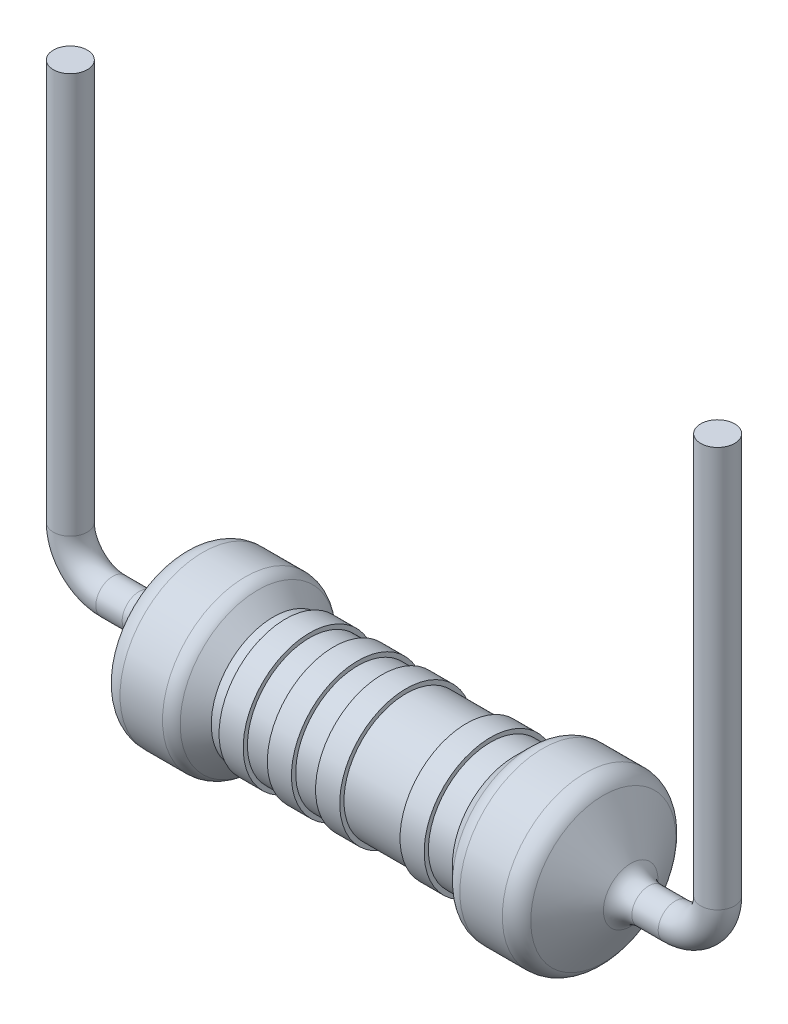
ISO-10303-21;
HEADER;
FILE_DESCRIPTION(('STEP AP214'),'2;1');
FILE_NAME('part.step','',(''),(''),'','','');
FILE_SCHEMA(('AUTOMOTIVE_DESIGN { 1 0 10303 214 1 1 1 1 }'));
ENDSEC;
DATA;
#1=APPLICATION_CONTEXT('core data for automotive mechanical design processes');
#2=APPLICATION_PROTOCOL_DEFINITION('international standard','automotive_design',2000,#1);
#3=PRODUCT_CONTEXT('',#1,'mechanical');
#4=PRODUCT('Part','Part','',(#3));
#5=PRODUCT_RELATED_PRODUCT_CATEGORY('part','',(#4));
#6=PRODUCT_DEFINITION_FORMATION('','',#4);
#7=PRODUCT_DEFINITION_CONTEXT('part definition',#1,'design');
#8=PRODUCT_DEFINITION('design','',#6,#7);
#9=PRODUCT_DEFINITION_SHAPE('','',#8);
#10=(LENGTH_UNIT() NAMED_UNIT(*) SI_UNIT(.MILLI.,.METRE.));
#11=(NAMED_UNIT(*) PLANE_ANGLE_UNIT() SI_UNIT($,.RADIAN.));
#12=(NAMED_UNIT(*) SI_UNIT($,.STERADIAN.) SOLID_ANGLE_UNIT());
#13=UNCERTAINTY_MEASURE_WITH_UNIT(LENGTH_MEASURE(1.E-05),#10,'distance_accuracy_value','');
#14=(GEOMETRIC_REPRESENTATION_CONTEXT(3) GLOBAL_UNCERTAINTY_ASSIGNED_CONTEXT((#13)) GLOBAL_UNIT_ASSIGNED_CONTEXT((#10,
#11,#12)) REPRESENTATION_CONTEXT('',''));
#15=CARTESIAN_POINT('',(0.,0.,0.));
#16=DIRECTION('',(0.,0.,1.));
#17=DIRECTION('',(1.,0.,0.));
#18=AXIS2_PLACEMENT_3D('',#15,#16,#17);
#19=CARTESIAN_POINT('',(-7.42,10.4292036732051,0.));
#20=DIRECTION('',(0.,1.,0.));
#21=DIRECTION('',(0.,0.,1.));
#22=AXIS2_PLACEMENT_3D('',#19,#20,#21);
#23=PLANE('',#22);
#24=CARTESIAN_POINT('',(-7.62,10.4292036732051,0.));
#25=DIRECTION('',(0.,-1.,0.));
#26=DIRECTION('',(0.,0.,-1.));
#27=AXIS2_PLACEMENT_3D('',#24,#25,#26);
#28=CIRCLE('',#27,0.4);
#29=CARTESIAN_POINT('',(-7.62,10.4292036732051,-0.400000000000006));
#30=VERTEX_POINT('',#29);
#31=EDGE_CURVE('E16',#30,#30,#28,.T.);
#32=ORIENTED_EDGE('',*,*,#31,.F.);
#33=EDGE_LOOP('',(#32));
#34=FACE_BOUND('',#33,.T.);
#35=ADVANCED_FACE('F13',(#34),#23,.T.);
#36=CARTESIAN_POINT('',(-7.62,4.6192036732051,0.));
#37=DIRECTION('',(0.,-1.,0.));
#38=DIRECTION('',(0.,0.,-1.));
#39=AXIS2_PLACEMENT_3D('',#36,#37,#38);
#40=CYLINDRICAL_SURFACE('',#39,0.4);
#41=CARTESIAN_POINT('',(-7.62,1.,0.));
#42=DIRECTION('',(0.,1.,0.));
#43=DIRECTION('',(-1.,0.,0.));
#44=AXIS2_PLACEMENT_3D('',#41,#42,#43);
#45=CIRCLE('',#44,0.399999999999999);
#46=CARTESIAN_POINT('',(-8.02,1.,0.));
#47=VERTEX_POINT('',#46);
#48=EDGE_CURVE('E179',#47,#47,#45,.F.);
#49=ORIENTED_EDGE('',*,*,#48,.F.);
#50=EDGE_LOOP('',(#49));
#51=FACE_BOUND('',#50,.T.);
#52=ORIENTED_EDGE('',*,*,#31,.T.);
#53=EDGE_LOOP('',(#52));
#54=FACE_BOUND('',#53,.T.);
#55=ADVANCED_FACE('F172',(#51,#54),#40,.T.);
#56=CARTESIAN_POINT('',(-6.62,1.,0.));
#57=DIRECTION('',(0.,0.,-1.));
#58=DIRECTION('',(-1.,0.,0.));
#59=AXIS2_PLACEMENT_3D('',#56,#57,#58);
#60=TOROIDAL_SURFACE('',#59,1.,0.399999999999999);
#61=CARTESIAN_POINT('',(-6.62,0.,0.));
#62=DIRECTION('',(1.,0.,0.));
#63=DIRECTION('',(0.,0.,-1.));
#64=AXIS2_PLACEMENT_3D('',#61,#62,#63);
#65=CIRCLE('',#64,0.4);
#66=CARTESIAN_POINT('',(-6.62,0.,-0.4));
#67=VERTEX_POINT('',#66);
#68=EDGE_CURVE('E182',#67,#67,#65,.T.);
#69=ORIENTED_EDGE('',*,*,#68,.F.);
#70=EDGE_LOOP('',(#69));
#71=FACE_BOUND('',#70,.T.);
#72=ORIENTED_EDGE('',*,*,#48,.T.);
#73=EDGE_LOOP('',(#72));
#74=FACE_BOUND('',#73,.T.);
#75=ADVANCED_FACE('F168',(#71,#74),#60,.T.);
#76=CARTESIAN_POINT('',(-11.81,0.,0.));
#77=DIRECTION('',(1.,0.,0.));
#78=DIRECTION('',(0.,0.,-1.));
#79=AXIS2_PLACEMENT_3D('',#76,#77,#78);
#80=CYLINDRICAL_SURFACE('',#79,0.4);
#81=CARTESIAN_POINT('',(-6.,0.,0.));
#82=DIRECTION('',(1.,0.,0.));
#83=DIRECTION('',(0.,0.,-1.));
#84=AXIS2_PLACEMENT_3D('',#81,#82,#83);
#85=CIRCLE('',#84,0.400000000000004);
#86=CARTESIAN_POINT('',(-6.,0.,-0.400000000000004));
#87=VERTEX_POINT('',#86);
#88=EDGE_CURVE('E155',#87,#87,#85,.F.);
#89=ORIENTED_EDGE('',*,*,#88,.T.);
#90=EDGE_LOOP('',(#89));
#91=FACE_BOUND('',#90,.T.);
#92=ORIENTED_EDGE('',*,*,#68,.T.);
#93=EDGE_LOOP('',(#92));
#94=FACE_BOUND('',#93,.T.);
#95=ADVANCED_FACE('F164',(#91,#94),#80,.T.);
#96=CARTESIAN_POINT('',(-6.,0.,0.));
#97=DIRECTION('',(1.,0.,0.));
#98=DIRECTION('',(0.,0.,-1.));
#99=AXIS2_PLACEMENT_3D('',#96,#97,#98);
#100=TOROIDAL_SURFACE('',#99,0.9,0.499999999999996);
#101=ORIENTED_EDGE('',*,*,#88,.F.);
#102=EDGE_LOOP('',(#101));
#103=FACE_BOUND('',#102,.T.);
#104=CARTESIAN_POINT('',(-5.57193017323243,0.,0.));
#105=DIRECTION('',(1.,0.,0.));
#106=DIRECTION('',(0.,1.,0.));
#107=AXIS2_PLACEMENT_3D('',#104,#105,#106);
#108=CIRCLE('',#107,0.641627743846129);
#109=CARTESIAN_POINT('',(-5.57193017323243,0.641627743846129,0.));
#110=VERTEX_POINT('',#109);
#111=EDGE_CURVE('E150',#110,#110,#108,.T.);
#112=ORIENTED_EDGE('',*,*,#111,.F.);
#113=EDGE_LOOP('',(#112));
#114=FACE_BOUND('',#113,.T.);
#115=ADVANCED_FACE('F161',(#103,#114),#100,.F.);
#116=CARTESIAN_POINT('',(-4.92806982668981,0.,0.));
#117=DIRECTION('',(1.,0.,0.));
#118=DIRECTION('',(0.,0.,-1.));
#119=AXIS2_PLACEMENT_3D('',#116,#117,#118);
#120=CONICAL_SURFACE('',#119,1.70837225601872,1.02775227654518);
#121=ORIENTED_EDGE('',*,*,#111,.T.);
#122=EDGE_LOOP('',(#121));
#123=FACE_BOUND('',#122,.T.);
#124=CARTESIAN_POINT('',(-4.92806982736351,0.,0.));
#125=DIRECTION('',(1.,0.,0.));
#126=DIRECTION('',(0.,0.,-1.));
#127=AXIS2_PLACEMENT_3D('',#124,#125,#126);
#128=CIRCLE('',#127,1.70837225644595);
#129=CARTESIAN_POINT('',(-4.92806982736351,0.,-1.70837225644595));
#130=VERTEX_POINT('',#129);
#131=EDGE_CURVE('E146',#130,#130,#128,.T.);
#132=ORIENTED_EDGE('',*,*,#131,.F.);
#133=EDGE_LOOP('',(#132));
#134=FACE_BOUND('',#133,.T.);
#135=ADVANCED_FACE('F138',(#123,#134),#120,.T.);
#136=CARTESIAN_POINT('',(-4.5,0.,0.));
#137=DIRECTION('',(1.,0.,0.));
#138=DIRECTION('',(0.,0.,-1.));
#139=AXIS2_PLACEMENT_3D('',#136,#137,#138);
#140=TOROIDAL_SURFACE('',#139,1.45,0.5);
#141=ORIENTED_EDGE('',*,*,#131,.T.);
#142=EDGE_LOOP('',(#141));
#143=FACE_BOUND('',#142,.T.);
#144=CARTESIAN_POINT('',(-4.5,0.,0.));
#145=DIRECTION('',(1.,0.,0.));
#146=DIRECTION('',(0.,0.,-1.));
#147=AXIS2_PLACEMENT_3D('',#144,#145,#146);
#148=CIRCLE('',#147,1.95);
#149=CARTESIAN_POINT('',(-4.5,0.,-1.95));
#150=VERTEX_POINT('',#149);
#151=EDGE_CURVE('E149',#150,#150,#148,.T.);
#152=ORIENTED_EDGE('',*,*,#151,.F.);
#153=EDGE_LOOP('',(#152));
#154=FACE_BOUND('',#153,.T.);
#155=ADVANCED_FACE('F133',(#143,#154),#140,.T.);
#156=CARTESIAN_POINT('',(-4.,0.,0.));
#157=DIRECTION('',(1.,0.,0.));
#158=DIRECTION('',(0.,0.,-1.));
#159=AXIS2_PLACEMENT_3D('',#156,#157,#158);
#160=CYLINDRICAL_SURFACE('',#159,1.95);
#161=ORIENTED_EDGE('',*,*,#151,.T.);
#162=EDGE_LOOP('',(#161));
#163=FACE_BOUND('',#162,.T.);
#164=CARTESIAN_POINT('',(-3.5,0.,0.));
#165=DIRECTION('',(1.,0.,0.));
#166=DIRECTION('',(0.,0.,-1.));
#167=AXIS2_PLACEMENT_3D('',#164,#165,#166);
#168=CIRCLE('',#167,1.95);
#169=CARTESIAN_POINT('',(-3.5,0.,-1.95));
#170=VERTEX_POINT('',#169);
#171=EDGE_CURVE('E116',#170,#170,#168,.T.);
#172=ORIENTED_EDGE('',*,*,#171,.F.);
#173=EDGE_LOOP('',(#172));
#174=FACE_BOUND('',#173,.T.);
#175=ADVANCED_FACE('F128',(#163,#174),#160,.T.);
#176=CARTESIAN_POINT('',(-3.5,0.,0.));
#177=DIRECTION('',(1.,0.,0.));
#178=DIRECTION('',(0.,0.,-1.));
#179=AXIS2_PLACEMENT_3D('',#176,#177,#178);
#180=TOROIDAL_SURFACE('',#179,1.53370686500769,0.416293134992312);
#181=ORIENTED_EDGE('',*,*,#171,.T.);
#182=EDGE_LOOP('',(#181));
#183=FACE_BOUND('',#182,.T.);
#184=CARTESIAN_POINT('',(-3.20563630145898,0.,0.));
#185=DIRECTION('',(-1.,0.,0.));
#186=DIRECTION('',(0.,1.,0.));
#187=AXIS2_PLACEMENT_3D('',#184,#185,#186);
#188=CIRCLE('',#187,1.8280705635334);
#189=CARTESIAN_POINT('',(-3.20563630145898,1.8280705635334,0.));
#190=VERTEX_POINT('',#189);
#191=EDGE_CURVE('E111',#190,#190,#188,.F.);
#192=ORIENTED_EDGE('',*,*,#191,.F.);
#193=EDGE_LOOP('',(#192));
#194=FACE_BOUND('',#193,.T.);
#195=ADVANCED_FACE('F123',(#183,#194),#180,.T.);
#196=CARTESIAN_POINT('',(-3.20563630140214,0.,0.));
#197=DIRECTION('',(-1.,0.,0.));
#198=DIRECTION('',(0.,0.,1.));
#199=AXIS2_PLACEMENT_3D('',#196,#197,#198);
#200=CONICAL_SURFACE('',#199,1.82807056347656,0.785398162464494);
#201=ORIENTED_EDGE('',*,*,#191,.T.);
#202=EDGE_LOOP('',(#201));
#203=FACE_BOUND('',#202,.T.);
#204=CARTESIAN_POINT('',(-2.84006573756337,0.,0.));
#205=DIRECTION('',(1.,0.,0.));
#206=DIRECTION('',(0.,0.,-1.));
#207=AXIS2_PLACEMENT_3D('',#204,#205,#206);
#208=CIRCLE('',#207,1.4625);
#209=CARTESIAN_POINT('',(-2.84006573756337,0.,-1.4625));
#210=VERTEX_POINT('',#209);
#211=EDGE_CURVE('E107',#210,#210,#208,.T.);
#212=ORIENTED_EDGE('',*,*,#211,.F.);
#213=EDGE_LOOP('',(#212));
#214=FACE_BOUND('',#213,.T.);
#215=ADVANCED_FACE('F127',(#203,#214),#200,.T.);
#216=CARTESIAN_POINT('',(0.,0.,0.));
#217=DIRECTION('',(1.,0.,0.));
#218=DIRECTION('',(0.,0.,-1.));
#219=AXIS2_PLACEMENT_3D('',#216,#217,#218);
#220=CYLINDRICAL_SURFACE('',#219,1.4625);
#221=ORIENTED_EDGE('',*,*,#211,.T.);
#222=EDGE_LOOP('',(#221));
#223=FACE_BOUND('',#222,.T.);
#224=CARTESIAN_POINT('',(-2.55605916380703,0.,0.));
#225=DIRECTION('',(1.,0.,0.));
#226=DIRECTION('',(0.,0.,-1.));
#227=AXIS2_PLACEMENT_3D('',#224,#225,#226);
#228=CIRCLE('',#227,1.4625);
#229=CARTESIAN_POINT('',(-2.55605916380703,0.,-1.4625));
#230=VERTEX_POINT('',#229);
#231=EDGE_CURVE('E110',#230,#230,#228,.T.);
#232=ORIENTED_EDGE('',*,*,#231,.F.);
#233=EDGE_LOOP('',(#232));
#234=FACE_BOUND('',#233,.T.);
#235=ADVANCED_FACE('F234',(#223,#234),#220,.T.);
#236=CARTESIAN_POINT('',(-2.55605916380703,0.,-1.5125));
#237=DIRECTION('',(-1.,0.,0.));
#238=DIRECTION('',(0.,0.,1.));
#239=AXIS2_PLACEMENT_3D('',#236,#237,#238);
#240=PLANE('',#239);
#241=ORIENTED_EDGE('',*,*,#231,.T.);
#242=EDGE_LOOP('',(#241));
#243=FACE_BOUND('',#242,.T.);
#244=CARTESIAN_POINT('',(-2.55605916380703,0.,0.));
#245=DIRECTION('',(1.,0.,0.));
#246=DIRECTION('',(0.,0.,-1.));
#247=AXIS2_PLACEMENT_3D('',#244,#245,#246);
#248=CIRCLE('',#247,1.5625);
#249=CARTESIAN_POINT('',(-2.55605916380703,0.,-1.5625));
#250=VERTEX_POINT('',#249);
#251=EDGE_CURVE('E226',#250,#250,#248,.T.);
#252=ORIENTED_EDGE('',*,*,#251,.F.);
#253=EDGE_LOOP('',(#252));
#254=FACE_BOUND('',#253,.T.);
#255=ADVANCED_FACE('F231',(#243,#254),#240,.T.);
#256=CARTESIAN_POINT('',(-2.27205259005069,0.,0.));
#257=DIRECTION('',(1.,0.,0.));
#258=DIRECTION('',(0.,0.,-1.));
#259=AXIS2_PLACEMENT_3D('',#256,#257,#258);
#260=CYLINDRICAL_SURFACE('',#259,1.5625);
#261=ORIENTED_EDGE('',*,*,#251,.T.);
#262=EDGE_LOOP('',(#261));
#263=FACE_BOUND('',#262,.T.);
#264=CARTESIAN_POINT('',(-1.98804601629436,0.,0.));
#265=DIRECTION('',(1.,0.,0.));
#266=DIRECTION('',(0.,0.,-1.));
#267=AXIS2_PLACEMENT_3D('',#264,#265,#266);
#268=CIRCLE('',#267,1.5625);
#269=CARTESIAN_POINT('',(-1.98804601629436,0.,-1.5625));
#270=VERTEX_POINT('',#269);
#271=EDGE_CURVE('E223',#270,#270,#268,.T.);
#272=ORIENTED_EDGE('',*,*,#271,.F.);
#273=EDGE_LOOP('',(#272));
#274=FACE_BOUND('',#273,.T.);
#275=ADVANCED_FACE('F242',(#263,#274),#260,.T.);
#276=CARTESIAN_POINT('',(-1.98804601629436,0.,-1.5125));
#277=DIRECTION('',(1.,0.,0.));
#278=DIRECTION('',(0.,0.,-1.));
#279=AXIS2_PLACEMENT_3D('',#276,#277,#278);
#280=PLANE('',#279);
#281=CARTESIAN_POINT('',(-1.98804601629436,0.,0.));
#282=DIRECTION('',(1.,0.,0.));
#283=DIRECTION('',(0.,0.,-1.));
#284=AXIS2_PLACEMENT_3D('',#281,#282,#283);
#285=CIRCLE('',#284,1.4625);
#286=CARTESIAN_POINT('',(-1.98804601629436,0.,-1.4625));
#287=VERTEX_POINT('',#286);
#288=EDGE_CURVE('E220',#287,#287,#285,.T.);
#289=ORIENTED_EDGE('',*,*,#288,.F.);
#290=EDGE_LOOP('',(#289));
#291=FACE_BOUND('',#290,.T.);
#292=ORIENTED_EDGE('',*,*,#271,.T.);
#293=EDGE_LOOP('',(#292));
#294=FACE_BOUND('',#293,.T.);
#295=ADVANCED_FACE('F394',(#291,#294),#280,.T.);
#296=CARTESIAN_POINT('',(0.,0.,0.));
#297=DIRECTION('',(1.,0.,0.));
#298=DIRECTION('',(0.,0.,-1.));
#299=AXIS2_PLACEMENT_3D('',#296,#297,#298);
#300=CYLINDRICAL_SURFACE('',#299,1.4625);
#301=ORIENTED_EDGE('',*,*,#288,.T.);
#302=EDGE_LOOP('',(#301));
#303=FACE_BOUND('',#302,.T.);
#304=CARTESIAN_POINT('',(-1.42003286878168,0.,0.));
#305=DIRECTION('',(1.,0.,0.));
#306=DIRECTION('',(0.,0.,-1.));
#307=AXIS2_PLACEMENT_3D('',#304,#305,#306);
#308=CIRCLE('',#307,1.4625);
#309=CARTESIAN_POINT('',(-1.42003286878168,0.,-1.4625));
#310=VERTEX_POINT('',#309);
#311=EDGE_CURVE('E217',#310,#310,#308,.T.);
#312=ORIENTED_EDGE('',*,*,#311,.F.);
#313=EDGE_LOOP('',(#312));
#314=FACE_BOUND('',#313,.T.);
#315=ADVANCED_FACE('F386',(#303,#314),#300,.T.);
#316=CARTESIAN_POINT('',(-1.42003286878168,0.,-1.5125));
#317=DIRECTION('',(-1.,0.,0.));
#318=DIRECTION('',(0.,0.,1.));
#319=AXIS2_PLACEMENT_3D('',#316,#317,#318);
#320=PLANE('',#319);
#321=ORIENTED_EDGE('',*,*,#311,.T.);
#322=EDGE_LOOP('',(#321));
#323=FACE_BOUND('',#322,.T.);
#324=CARTESIAN_POINT('',(-1.42003286878168,0.,0.));
#325=DIRECTION('',(1.,0.,0.));
#326=DIRECTION('',(0.,0.,-1.));
#327=AXIS2_PLACEMENT_3D('',#324,#325,#326);
#328=CIRCLE('',#327,1.5625);
#329=CARTESIAN_POINT('',(-1.42003286878168,0.,-1.5625));
#330=VERTEX_POINT('',#329);
#331=EDGE_CURVE('E214',#330,#330,#328,.T.);
#332=ORIENTED_EDGE('',*,*,#331,.F.);
#333=EDGE_LOOP('',(#332));
#334=FACE_BOUND('',#333,.T.);
#335=ADVANCED_FACE('F378',(#323,#334),#320,.T.);
#336=CARTESIAN_POINT('',(-1.13602629502535,0.,0.));
#337=DIRECTION('',(1.,0.,0.));
#338=DIRECTION('',(0.,0.,-1.));
#339=AXIS2_PLACEMENT_3D('',#336,#337,#338);
#340=CYLINDRICAL_SURFACE('',#339,1.5625);
#341=ORIENTED_EDGE('',*,*,#331,.T.);
#342=EDGE_LOOP('',(#341));
#343=FACE_BOUND('',#342,.T.);
#344=CARTESIAN_POINT('',(-0.852019721269009,0.,0.));
#345=DIRECTION('',(1.,0.,0.));
#346=DIRECTION('',(0.,0.,-1.));
#347=AXIS2_PLACEMENT_3D('',#344,#345,#346);
#348=CIRCLE('',#347,1.5625);
#349=CARTESIAN_POINT('',(-0.852019721269009,0.,-1.5625));
#350=VERTEX_POINT('',#349);
#351=EDGE_CURVE('E211',#350,#350,#348,.T.);
#352=ORIENTED_EDGE('',*,*,#351,.F.);
#353=EDGE_LOOP('',(#352));
#354=FACE_BOUND('',#353,.T.);
#355=ADVANCED_FACE('F370',(#343,#354),#340,.T.);
#356=CARTESIAN_POINT('',(-0.852019721269009,0.,-1.5125));
#357=DIRECTION('',(1.,0.,0.));
#358=DIRECTION('',(0.,0.,-1.));
#359=AXIS2_PLACEMENT_3D('',#356,#357,#358);
#360=PLANE('',#359);
#361=CARTESIAN_POINT('',(-0.852019721269009,0.,0.));
#362=DIRECTION('',(1.,0.,0.));
#363=DIRECTION('',(0.,0.,-1.));
#364=AXIS2_PLACEMENT_3D('',#361,#362,#363);
#365=CIRCLE('',#364,1.4625);
#366=CARTESIAN_POINT('',(-0.852019721269009,0.,-1.4625));
#367=VERTEX_POINT('',#366);
#368=EDGE_CURVE('E208',#367,#367,#365,.T.);
#369=ORIENTED_EDGE('',*,*,#368,.F.);
#370=EDGE_LOOP('',(#369));
#371=FACE_BOUND('',#370,.T.);
#372=ORIENTED_EDGE('',*,*,#351,.T.);
#373=EDGE_LOOP('',(#372));
#374=FACE_BOUND('',#373,.T.);
#375=ADVANCED_FACE('F362',(#371,#374),#360,.T.);
#376=CARTESIAN_POINT('',(0.,0.,0.));
#377=DIRECTION('',(1.,0.,0.));
#378=DIRECTION('',(0.,0.,-1.));
#379=AXIS2_PLACEMENT_3D('',#376,#377,#378);
#380=CYLINDRICAL_SURFACE('',#379,1.4625);
#381=CARTESIAN_POINT('',(-0.284006573756335,0.,0.));
#382=DIRECTION('',(1.,0.,0.));
#383=DIRECTION('',(0.,0.,-1.));
#384=AXIS2_PLACEMENT_3D('',#381,#382,#383);
#385=CIRCLE('',#384,1.4625);
#386=CARTESIAN_POINT('',(-0.284006573756335,0.,-1.4625));
#387=VERTEX_POINT('',#386);
#388=EDGE_CURVE('E205',#387,#387,#385,.T.);
#389=ORIENTED_EDGE('',*,*,#388,.F.);
#390=EDGE_LOOP('',(#389));
#391=FACE_BOUND('',#390,.T.);
#392=ORIENTED_EDGE('',*,*,#368,.T.);
#393=EDGE_LOOP('',(#392));
#394=FACE_BOUND('',#393,.T.);
#395=ADVANCED_FACE('F354',(#391,#394),#380,.T.);
#396=CARTESIAN_POINT('',(-0.284006573756335,0.,-1.5125));
#397=DIRECTION('',(-1.,0.,0.));
#398=DIRECTION('',(0.,0.,1.));
#399=AXIS2_PLACEMENT_3D('',#396,#397,#398);
#400=PLANE('',#399);
#401=ORIENTED_EDGE('',*,*,#388,.T.);
#402=EDGE_LOOP('',(#401));
#403=FACE_BOUND('',#402,.T.);
#404=CARTESIAN_POINT('',(-0.284006573756335,0.,0.));
#405=DIRECTION('',(1.,0.,0.));
#406=DIRECTION('',(0.,0.,-1.));
#407=AXIS2_PLACEMENT_3D('',#404,#405,#406);
#408=CIRCLE('',#407,1.5625);
#409=CARTESIAN_POINT('',(-0.284006573756335,0.,-1.5625));
#410=VERTEX_POINT('',#409);
#411=EDGE_CURVE('E202',#410,#410,#408,.T.);
#412=ORIENTED_EDGE('',*,*,#411,.F.);
#413=EDGE_LOOP('',(#412));
#414=FACE_BOUND('',#413,.T.);
#415=ADVANCED_FACE('F346',(#403,#414),#400,.T.);
#416=CARTESIAN_POINT('',(0.,0.,0.));
#417=DIRECTION('',(1.,0.,0.));
#418=DIRECTION('',(0.,0.,-1.));
#419=AXIS2_PLACEMENT_3D('',#416,#417,#418);
#420=CYLINDRICAL_SURFACE('',#419,1.5625);
#421=ORIENTED_EDGE('',*,*,#411,.T.);
#422=EDGE_LOOP('',(#421));
#423=FACE_BOUND('',#422,.T.);
#424=CARTESIAN_POINT('',(0.284006573756339,0.,0.));
#425=DIRECTION('',(1.,0.,0.));
#426=DIRECTION('',(0.,0.,-1.));
#427=AXIS2_PLACEMENT_3D('',#424,#425,#426);
#428=CIRCLE('',#427,1.5625);
#429=CARTESIAN_POINT('',(0.284006573756339,0.,-1.5625));
#430=VERTEX_POINT('',#429);
#431=EDGE_CURVE('E199',#430,#430,#428,.T.);
#432=ORIENTED_EDGE('',*,*,#431,.F.);
#433=EDGE_LOOP('',(#432));
#434=FACE_BOUND('',#433,.T.);
#435=ADVANCED_FACE('F338',(#423,#434),#420,.T.);
#436=CARTESIAN_POINT('',(0.284006573756339,0.,-1.5125));
#437=DIRECTION('',(1.,0.,0.));
#438=DIRECTION('',(0.,0.,-1.));
#439=AXIS2_PLACEMENT_3D('',#436,#437,#438);
#440=PLANE('',#439);
#441=CARTESIAN_POINT('',(0.284006573756339,0.,0.));
#442=DIRECTION('',(1.,0.,0.));
#443=DIRECTION('',(0.,0.,-1.));
#444=AXIS2_PLACEMENT_3D('',#441,#442,#443);
#445=CIRCLE('',#444,1.4625);
#446=CARTESIAN_POINT('',(0.284006573756339,0.,-1.4625));
#447=VERTEX_POINT('',#446);
#448=EDGE_CURVE('E196',#447,#447,#445,.T.);
#449=ORIENTED_EDGE('',*,*,#448,.F.);
#450=EDGE_LOOP('',(#449));
#451=FACE_BOUND('',#450,.T.);
#452=ORIENTED_EDGE('',*,*,#431,.T.);
#453=EDGE_LOOP('',(#452));
#454=FACE_BOUND('',#453,.T.);
#455=ADVANCED_FACE('F330',(#451,#454),#440,.T.);
#456=CARTESIAN_POINT('',(0.,0.,0.));
#457=DIRECTION('',(1.,0.,0.));
#458=DIRECTION('',(0.,0.,-1.));
#459=AXIS2_PLACEMENT_3D('',#456,#457,#458);
#460=CYLINDRICAL_SURFACE('',#459,1.4625);
#461=ORIENTED_EDGE('',*,*,#448,.T.);
#462=EDGE_LOOP('',(#461));
#463=FACE_BOUND('',#462,.T.);
#464=CARTESIAN_POINT('',(1.70403944253802,0.,0.));
#465=DIRECTION('',(1.,0.,0.));
#466=DIRECTION('',(0.,0.,-1.));
#467=AXIS2_PLACEMENT_3D('',#464,#465,#466);
#468=CIRCLE('',#467,1.4625);
#469=CARTESIAN_POINT('',(1.70403944253802,0.,-1.4625));
#470=VERTEX_POINT('',#469);
#471=EDGE_CURVE('E193',#470,#470,#468,.T.);
#472=ORIENTED_EDGE('',*,*,#471,.F.);
#473=EDGE_LOOP('',(#472));
#474=FACE_BOUND('',#473,.T.);
#475=ADVANCED_FACE('F322',(#463,#474),#460,.T.);
#476=CARTESIAN_POINT('',(1.70403944253802,0.,-1.5125));
#477=DIRECTION('',(-1.,0.,0.));
#478=DIRECTION('',(0.,0.,1.));
#479=AXIS2_PLACEMENT_3D('',#476,#477,#478);
#480=PLANE('',#479);
#481=ORIENTED_EDGE('',*,*,#471,.T.);
#482=EDGE_LOOP('',(#481));
#483=FACE_BOUND('',#482,.T.);
#484=CARTESIAN_POINT('',(1.70403944253802,0.,0.));
#485=DIRECTION('',(1.,0.,0.));
#486=DIRECTION('',(0.,0.,-1.));
#487=AXIS2_PLACEMENT_3D('',#484,#485,#486);
#488=CIRCLE('',#487,1.5625);
#489=CARTESIAN_POINT('',(1.70403944253802,0.,-1.5625));
#490=VERTEX_POINT('',#489);
#491=EDGE_CURVE('E190',#490,#490,#488,.T.);
#492=ORIENTED_EDGE('',*,*,#491,.F.);
#493=EDGE_LOOP('',(#492));
#494=FACE_BOUND('',#493,.T.);
#495=ADVANCED_FACE('F314',(#483,#494),#480,.T.);
#496=CARTESIAN_POINT('',(1.98804601629436,0.,0.));
#497=DIRECTION('',(1.,0.,0.));
#498=DIRECTION('',(0.,0.,-1.));
#499=AXIS2_PLACEMENT_3D('',#496,#497,#498);
#500=CYLINDRICAL_SURFACE('',#499,1.5625);
#501=ORIENTED_EDGE('',*,*,#491,.T.);
#502=EDGE_LOOP('',(#501));
#503=FACE_BOUND('',#502,.T.);
#504=CARTESIAN_POINT('',(2.2720525900507,0.,0.));
#505=DIRECTION('',(1.,0.,0.));
#506=DIRECTION('',(0.,0.,-1.));
#507=AXIS2_PLACEMENT_3D('',#504,#505,#506);
#508=CIRCLE('',#507,1.5625);
#509=CARTESIAN_POINT('',(2.2720525900507,0.,-1.5625));
#510=VERTEX_POINT('',#509);
#511=EDGE_CURVE('E187',#510,#510,#508,.T.);
#512=ORIENTED_EDGE('',*,*,#511,.F.);
#513=EDGE_LOOP('',(#512));
#514=FACE_BOUND('',#513,.T.);
#515=ADVANCED_FACE('F306',(#503,#514),#500,.T.);
#516=CARTESIAN_POINT('',(2.2720525900507,0.,-1.5125));
#517=DIRECTION('',(1.,0.,0.));
#518=DIRECTION('',(0.,0.,-1.));
#519=AXIS2_PLACEMENT_3D('',#516,#517,#518);
#520=PLANE('',#519);
#521=CARTESIAN_POINT('',(2.2720525900507,0.,0.));
#522=DIRECTION('',(1.,0.,0.));
#523=DIRECTION('',(0.,0.,-1.));
#524=AXIS2_PLACEMENT_3D('',#521,#522,#523);
#525=CIRCLE('',#524,1.4625);
#526=CARTESIAN_POINT('',(2.2720525900507,0.,-1.4625));
#527=VERTEX_POINT('',#526);
#528=EDGE_CURVE('E104',#527,#527,#525,.T.);
#529=ORIENTED_EDGE('',*,*,#528,.F.);
#530=EDGE_LOOP('',(#529));
#531=FACE_BOUND('',#530,.T.);
#532=ORIENTED_EDGE('',*,*,#511,.T.);
#533=EDGE_LOOP('',(#532));
#534=FACE_BOUND('',#533,.T.);
#535=ADVANCED_FACE('F299',(#531,#534),#520,.T.);
#536=CARTESIAN_POINT('',(0.,0.,0.));
#537=DIRECTION('',(1.,0.,0.));
#538=DIRECTION('',(0.,0.,-1.));
#539=AXIS2_PLACEMENT_3D('',#536,#537,#538);
#540=CYLINDRICAL_SURFACE('',#539,1.4625);
#541=CARTESIAN_POINT('',(2.84006573741635,0.,0.));
#542=DIRECTION('',(1.,0.,0.));
#543=DIRECTION('',(0.,1.,0.));
#544=AXIS2_PLACEMENT_3D('',#541,#542,#543);
#545=CIRCLE('',#544,1.46250000022974);
#546=CARTESIAN_POINT('',(2.84006573741635,1.46250000022974,0.));
#547=VERTEX_POINT('',#546);
#548=EDGE_CURVE('E99',#547,#547,#545,.T.);
#549=ORIENTED_EDGE('',*,*,#548,.F.);
#550=EDGE_LOOP('',(#549));
#551=FACE_BOUND('',#550,.T.);
#552=ORIENTED_EDGE('',*,*,#528,.T.);
#553=EDGE_LOOP('',(#552));
#554=FACE_BOUND('',#553,.T.);
#555=ADVANCED_FACE('F292',(#551,#554),#540,.T.);
#556=CARTESIAN_POINT('',(3.20563630134529,0.,0.));
#557=DIRECTION('',(1.,0.,0.));
#558=DIRECTION('',(0.,0.,-1.));
#559=AXIS2_PLACEMENT_3D('',#556,#557,#558);
#560=CONICAL_SURFACE('',#559,1.82807056347656,0.785398162464494);
#561=ORIENTED_EDGE('',*,*,#548,.T.);
#562=EDGE_LOOP('',(#561));
#563=FACE_BOUND('',#562,.T.);
#564=CARTESIAN_POINT('',(3.20563630128553,0.,0.));
#565=DIRECTION('',(1.,0.,0.));
#566=DIRECTION('',(0.,0.,-1.));
#567=AXIS2_PLACEMENT_3D('',#564,#565,#566);
#568=CIRCLE('',#567,1.82807056372216);
#569=CARTESIAN_POINT('',(3.20563630128553,0.,-1.82807056372216));
#570=VERTEX_POINT('',#569);
#571=EDGE_CURVE('E95',#570,#570,#568,.T.);
#572=ORIENTED_EDGE('',*,*,#571,.F.);
#573=EDGE_LOOP('',(#572));
#574=FACE_BOUND('',#573,.T.);
#575=ADVANCED_FACE('F87',(#563,#574),#560,.T.);
#576=CARTESIAN_POINT('',(3.5,0.,0.));
#577=DIRECTION('',(1.,0.,0.));
#578=DIRECTION('',(0.,0.,-1.));
#579=AXIS2_PLACEMENT_3D('',#576,#577,#578);
#580=TOROIDAL_SURFACE('',#579,1.53370686500769,0.416293134992312);
#581=ORIENTED_EDGE('',*,*,#571,.T.);
#582=EDGE_LOOP('',(#581));
#583=FACE_BOUND('',#582,.T.);
#584=CARTESIAN_POINT('',(3.5,0.,0.));
#585=DIRECTION('',(1.,0.,0.));
#586=DIRECTION('',(0.,0.,-1.));
#587=AXIS2_PLACEMENT_3D('',#584,#585,#586);
#588=CIRCLE('',#587,1.95);
#589=CARTESIAN_POINT('',(3.5,0.,-1.95));
#590=VERTEX_POINT('',#589);
#591=EDGE_CURVE('E98',#590,#590,#588,.T.);
#592=ORIENTED_EDGE('',*,*,#591,.F.);
#593=EDGE_LOOP('',(#592));
#594=FACE_BOUND('',#593,.T.);
#595=ADVANCED_FACE('F82',(#583,#594),#580,.T.);
#596=CARTESIAN_POINT('',(4.,0.,0.));
#597=DIRECTION('',(1.,0.,0.));
#598=DIRECTION('',(0.,0.,-1.));
#599=AXIS2_PLACEMENT_3D('',#596,#597,#598);
#600=CYLINDRICAL_SURFACE('',#599,1.95);
#601=ORIENTED_EDGE('',*,*,#591,.T.);
#602=EDGE_LOOP('',(#601));
#603=FACE_BOUND('',#602,.T.);
#604=CARTESIAN_POINT('',(4.5,0.,0.));
#605=DIRECTION('',(1.,0.,0.));
#606=DIRECTION('',(0.,0.,-1.));
#607=AXIS2_PLACEMENT_3D('',#604,#605,#606);
#608=CIRCLE('',#607,1.95);
#609=CARTESIAN_POINT('',(4.5,0.,-1.95));
#610=VERTEX_POINT('',#609);
#611=EDGE_CURVE('E69',#610,#610,#608,.T.);
#612=ORIENTED_EDGE('',*,*,#611,.F.);
#613=EDGE_LOOP('',(#612));
#614=FACE_BOUND('',#613,.T.);
#615=ADVANCED_FACE('F78',(#603,#614),#600,.T.);
#616=CARTESIAN_POINT('',(4.5,0.,0.));
#617=DIRECTION('',(1.,0.,0.));
#618=DIRECTION('',(0.,0.,-1.));
#619=AXIS2_PLACEMENT_3D('',#616,#617,#618);
#620=TOROIDAL_SURFACE('',#619,1.45,0.5);
#621=ORIENTED_EDGE('',*,*,#611,.T.);
#622=EDGE_LOOP('',(#621));
#623=FACE_BOUND('',#622,.T.);
#624=CARTESIAN_POINT('',(4.92806982668981,0.,0.));
#625=DIRECTION('',(-1.,0.,0.));
#626=DIRECTION('',(0.,1.,0.));
#627=AXIS2_PLACEMENT_3D('',#624,#625,#626);
#628=CIRCLE('',#627,1.70837225601872);
#629=CARTESIAN_POINT('',(4.92806982668981,1.70837225601872,0.));
#630=VERTEX_POINT('',#629);
#631=EDGE_CURVE('E64',#630,#630,#628,.F.);
#632=ORIENTED_EDGE('',*,*,#631,.F.);
#633=EDGE_LOOP('',(#632));
#634=FACE_BOUND('',#633,.T.);
#635=ADVANCED_FACE('F75',(#623,#634),#620,.T.);
#636=CARTESIAN_POINT('',(4.92806982668981,0.,0.));
#637=DIRECTION('',(-1.,0.,0.));
#638=DIRECTION('',(0.,0.,1.));
#639=AXIS2_PLACEMENT_3D('',#636,#637,#638);
#640=CONICAL_SURFACE('',#639,1.70837225601872,1.02775227654518);
#641=ORIENTED_EDGE('',*,*,#631,.T.);
#642=EDGE_LOOP('',(#641));
#643=FACE_BOUND('',#642,.T.);
#644=CARTESIAN_POINT('',(5.57193017263649,0.,0.));
#645=DIRECTION('',(1.,0.,0.));
#646=DIRECTION('',(0.,0.,-1.));
#647=AXIS2_PLACEMENT_3D('',#644,#645,#646);
#648=CIRCLE('',#647,0.641627743554053);
#649=CARTESIAN_POINT('',(5.57193017263649,0.,-0.641627743554053));
#650=VERTEX_POINT('',#649);
#651=EDGE_CURVE('E60',#650,#650,#648,.F.);
#652=ORIENTED_EDGE('',*,*,#651,.T.);
#653=EDGE_LOOP('',(#652));
#654=FACE_BOUND('',#653,.T.);
#655=ADVANCED_FACE('F52',(#643,#654),#640,.T.);
#656=CARTESIAN_POINT('',(6.,0.,0.));
#657=DIRECTION('',(1.,0.,0.));
#658=DIRECTION('',(0.,0.,-1.));
#659=AXIS2_PLACEMENT_3D('',#656,#657,#658);
#660=TOROIDAL_SURFACE('',#659,0.9,0.499999999999996);
#661=ORIENTED_EDGE('',*,*,#651,.F.);
#662=EDGE_LOOP('',(#661));
#663=FACE_BOUND('',#662,.T.);
#664=CARTESIAN_POINT('',(6.,0.,0.));
#665=DIRECTION('',(1.,0.,0.));
#666=DIRECTION('',(0.,0.,-1.));
#667=AXIS2_PLACEMENT_3D('',#664,#665,#666);
#668=CIRCLE('',#667,0.4);
#669=CARTESIAN_POINT('',(6.,0.,-0.4));
#670=VERTEX_POINT('',#669);
#671=EDGE_CURVE('E63',#670,#670,#668,.T.);
#672=ORIENTED_EDGE('',*,*,#671,.F.);
#673=EDGE_LOOP('',(#672));
#674=FACE_BOUND('',#673,.T.);
#675=ADVANCED_FACE('F47',(#663,#674),#660,.F.);
#676=CARTESIAN_POINT('',(11.81,0.,0.));
#677=DIRECTION('',(1.,0.,0.));
#678=DIRECTION('',(0.,0.,-1.));
#679=AXIS2_PLACEMENT_3D('',#676,#677,#678);
#680=CYLINDRICAL_SURFACE('',#679,0.4);
#681=ORIENTED_EDGE('',*,*,#671,.T.);
#682=EDGE_LOOP('',(#681));
#683=FACE_BOUND('',#682,.T.);
#684=CARTESIAN_POINT('',(6.62,0.,0.));
#685=DIRECTION('',(1.,0.,0.));
#686=DIRECTION('',(0.,-1.,0.));
#687=AXIS2_PLACEMENT_3D('',#684,#685,#686);
#688=CIRCLE('',#687,0.400000000000001);
#689=CARTESIAN_POINT('',(6.62,-0.400000000000001,0.));
#690=VERTEX_POINT('',#689);
#691=EDGE_CURVE('E25',#690,#690,#688,.T.);
#692=ORIENTED_EDGE('',*,*,#691,.F.);
#693=EDGE_LOOP('',(#692));
#694=FACE_BOUND('',#693,.T.);
#695=ADVANCED_FACE('F43',(#683,#694),#680,.T.);
#696=CARTESIAN_POINT('',(7.42,10.4292036732051,0.));
#697=DIRECTION('',(0.,1.,0.));
#698=DIRECTION('',(0.,0.,1.));
#699=AXIS2_PLACEMENT_3D('',#696,#697,#698);
#700=PLANE('',#699);
#701=CARTESIAN_POINT('',(7.62,10.4292036732051,0.));
#702=DIRECTION('',(0.,1.,0.));
#703=DIRECTION('',(-1.,0.,0.));
#704=AXIS2_PLACEMENT_3D('',#701,#702,#703);
#705=CIRCLE('',#704,0.4);
#706=CARTESIAN_POINT('',(7.22,10.4292036732051,0.));
#707=VERTEX_POINT('',#706);
#708=EDGE_CURVE('E20',#707,#707,#705,.F.);
#709=ORIENTED_EDGE('',*,*,#708,.F.);
#710=EDGE_LOOP('',(#709));
#711=FACE_BOUND('',#710,.T.);
#712=ADVANCED_FACE('F39',(#711),#700,.T.);
#713=CARTESIAN_POINT('',(6.62,1.,0.));
#714=DIRECTION('',(0.,0.,1.));
#715=DIRECTION('',(1.,0.,0.));
#716=AXIS2_PLACEMENT_3D('',#713,#714,#715);
#717=TOROIDAL_SURFACE('',#716,1.,0.400000000000001);
#718=ORIENTED_EDGE('',*,*,#691,.T.);
#719=EDGE_LOOP('',(#718));
#720=FACE_BOUND('',#719,.T.);
#721=CARTESIAN_POINT('',(7.62,1.,0.));
#722=DIRECTION('',(0.,1.,0.));
#723=DIRECTION('',(-1.,0.,0.));
#724=AXIS2_PLACEMENT_3D('',#721,#722,#723);
#725=CIRCLE('',#724,0.4);
#726=CARTESIAN_POINT('',(7.22,1.,0.));
#727=VERTEX_POINT('',#726);
#728=EDGE_CURVE('E8',#727,#727,#725,.T.);
#729=ORIENTED_EDGE('',*,*,#728,.F.);
#730=EDGE_LOOP('',(#729));
#731=FACE_BOUND('',#730,.T.);
#732=ADVANCED_FACE('F34',(#720,#731),#717,.T.);
#733=CARTESIAN_POINT('',(7.62,4.6192036732051,0.));
#734=DIRECTION('',(0.,1.,0.));
#735=DIRECTION('',(-1.,0.,0.));
#736=AXIS2_PLACEMENT_3D('',#733,#734,#735);
#737=CYLINDRICAL_SURFACE('',#736,0.4);
#738=ORIENTED_EDGE('',*,*,#728,.T.);
#739=EDGE_LOOP('',(#738));
#740=FACE_BOUND('',#739,.T.);
#741=ORIENTED_EDGE('',*,*,#708,.T.);
#742=EDGE_LOOP('',(#741));
#743=FACE_BOUND('',#742,.T.);
#744=ADVANCED_FACE('F38',(#740,#743),#737,.T.);
#745=CLOSED_SHELL('',(#35,#55,#75,#95,#115,#135,#155,#175,#195,#215,#235,#255,#275,#295,#315,
#335,#355,#375,#395,#415,#435,#455,#475,#495,#515,#535,#555,#575,#595,#615,#635,#655,#675,#695,
#712,#732,#744));
#746=MANIFOLD_SOLID_BREP('B1',#745);
#747=ADVANCED_BREP_SHAPE_REPRESENTATION('',(#18,#746),#14);
#748=SHAPE_DEFINITION_REPRESENTATION(#9,#747);
ENDSEC;
END-ISO-10303-21;
